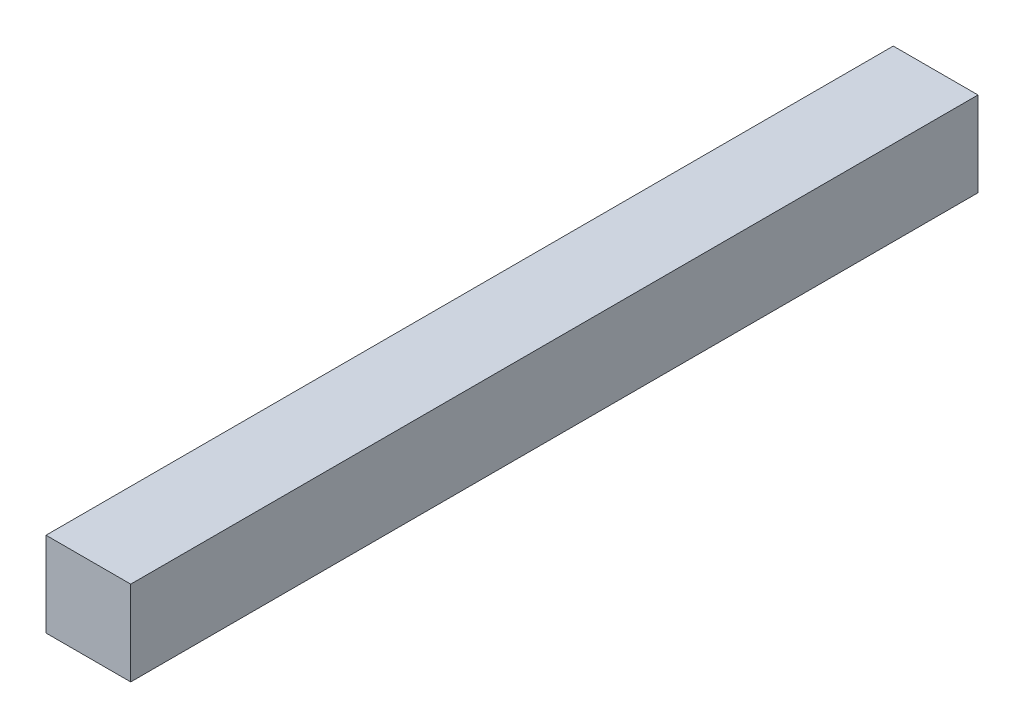
ISO-10303-21;
HEADER;
FILE_DESCRIPTION(('STEP AP214'),'2;1');
FILE_NAME('part.step','',(''),(''),'','','');
FILE_SCHEMA(('AUTOMOTIVE_DESIGN { 1 0 10303 214 1 1 1 1 }'));
ENDSEC;
DATA;
#1=APPLICATION_CONTEXT('core data for automotive mechanical design processes');
#2=APPLICATION_PROTOCOL_DEFINITION('international standard','automotive_design',2000,#1);
#3=PRODUCT_CONTEXT('',#1,'mechanical');
#4=PRODUCT('Part','Part','',(#3));
#5=PRODUCT_RELATED_PRODUCT_CATEGORY('part','',(#4));
#6=PRODUCT_DEFINITION_FORMATION('','',#4);
#7=PRODUCT_DEFINITION_CONTEXT('part definition',#1,'design');
#8=PRODUCT_DEFINITION('design','',#6,#7);
#9=PRODUCT_DEFINITION_SHAPE('','',#8);
#10=(LENGTH_UNIT() NAMED_UNIT(*) SI_UNIT(.MILLI.,.METRE.));
#11=(NAMED_UNIT(*) PLANE_ANGLE_UNIT() SI_UNIT($,.RADIAN.));
#12=(NAMED_UNIT(*) SI_UNIT($,.STERADIAN.) SOLID_ANGLE_UNIT());
#13=UNCERTAINTY_MEASURE_WITH_UNIT(LENGTH_MEASURE(1.E-05),#10,'distance_accuracy_value','');
#14=(GEOMETRIC_REPRESENTATION_CONTEXT(3) GLOBAL_UNCERTAINTY_ASSIGNED_CONTEXT((#13)) GLOBAL_UNIT_ASSIGNED_CONTEXT((#10,
#11,#12)) REPRESENTATION_CONTEXT('',''));
#15=CARTESIAN_POINT('',(0.,0.,0.));
#16=DIRECTION('',(0.,0.,1.));
#17=DIRECTION('',(1.,0.,0.));
#18=AXIS2_PLACEMENT_3D('',#15,#16,#17);
#19=CARTESIAN_POINT('',(0.,0.,30.));
#20=DIRECTION('',(-1.,0.,0.));
#21=DIRECTION('',(0.,0.,1.));
#22=AXIS2_PLACEMENT_3D('',#19,#20,#21);
#23=PLANE('',#22);
#24=DIRECTION('',(0.,1.,0.));
#25=VECTOR('',#24,1.);
#26=CARTESIAN_POINT('',(0.,0.,0.));
#27=LINE('',#26,#25);
#28=CARTESIAN_POINT('',(0.,0.,0.));
#29=VERTEX_POINT('',#28);
#30=CARTESIAN_POINT('',(0.,3.,0.));
#31=VERTEX_POINT('',#30);
#32=EDGE_CURVE('E110',#29,#31,#27,.T.);
#33=ORIENTED_EDGE('',*,*,#32,.F.);
#34=DIRECTION('',(0.,0.,-1.));
#35=VECTOR('',#34,1.);
#36=CARTESIAN_POINT('',(0.,0.,30.));
#37=LINE('',#36,#35);
#38=CARTESIAN_POINT('',(0.,0.,30.));
#39=VERTEX_POINT('',#38);
#40=EDGE_CURVE('E11',#39,#29,#37,.T.);
#41=ORIENTED_EDGE('',*,*,#40,.F.);
#42=DIRECTION('',(0.,1.,0.));
#43=VECTOR('',#42,1.);
#44=CARTESIAN_POINT('',(0.,0.,30.));
#45=LINE('',#44,#43);
#46=CARTESIAN_POINT('',(0.,3.,30.));
#47=VERTEX_POINT('',#46);
#48=EDGE_CURVE('E103',#39,#47,#45,.T.);
#49=ORIENTED_EDGE('',*,*,#48,.T.);
#50=DIRECTION('',(0.,0.,-1.));
#51=VECTOR('',#50,1.);
#52=CARTESIAN_POINT('',(0.,3.,30.));
#53=LINE('',#52,#51);
#54=EDGE_CURVE('E42',#47,#31,#53,.T.);
#55=ORIENTED_EDGE('',*,*,#54,.T.);
#56=EDGE_LOOP('',(#33,#41,#49,#55));
#57=FACE_BOUND('',#56,.T.);
#58=ADVANCED_FACE('F39',(#57),#23,.T.);
#59=CARTESIAN_POINT('',(0.,0.,30.));
#60=DIRECTION('',(0.,1.,0.));
#61=DIRECTION('',(0.,0.,1.));
#62=AXIS2_PLACEMENT_3D('',#59,#60,#61);
#63=PLANE('',#62);
#64=DIRECTION('',(1.,0.,0.));
#65=VECTOR('',#64,1.);
#66=CARTESIAN_POINT('',(0.,0.,0.));
#67=LINE('',#66,#65);
#68=CARTESIAN_POINT('',(3.,0.,0.));
#69=VERTEX_POINT('',#68);
#70=EDGE_CURVE('E73',#29,#69,#67,.T.);
#71=ORIENTED_EDGE('',*,*,#70,.T.);
#72=DIRECTION('',(0.,0.,-1.));
#73=VECTOR('',#72,1.);
#74=CARTESIAN_POINT('',(3.,0.,30.));
#75=LINE('',#74,#73);
#76=CARTESIAN_POINT('',(3.,0.,30.));
#77=VERTEX_POINT('',#76);
#78=EDGE_CURVE('E49',#77,#69,#75,.T.);
#79=ORIENTED_EDGE('',*,*,#78,.F.);
#80=DIRECTION('',(1.,0.,0.));
#81=VECTOR('',#80,1.);
#82=CARTESIAN_POINT('',(0.,0.,30.));
#83=LINE('',#82,#81);
#84=EDGE_CURVE('E90',#39,#77,#83,.T.);
#85=ORIENTED_EDGE('',*,*,#84,.F.);
#86=ORIENTED_EDGE('',*,*,#40,.T.);
#87=EDGE_LOOP('',(#71,#79,#85,#86));
#88=FACE_BOUND('',#87,.T.);
#89=ADVANCED_FACE('F126',(#88),#63,.F.);
#90=CARTESIAN_POINT('',(3.,0.,30.));
#91=DIRECTION('',(-1.,0.,0.));
#92=DIRECTION('',(0.,0.,1.));
#93=AXIS2_PLACEMENT_3D('',#90,#91,#92);
#94=PLANE('',#93);
#95=DIRECTION('',(0.,1.,0.));
#96=VECTOR('',#95,1.);
#97=CARTESIAN_POINT('',(3.,0.,0.));
#98=LINE('',#97,#96);
#99=CARTESIAN_POINT('',(3.,3.,0.));
#100=VERTEX_POINT('',#99);
#101=EDGE_CURVE('E98',#69,#100,#98,.T.);
#102=ORIENTED_EDGE('',*,*,#101,.T.);
#103=DIRECTION('',(0.,0.,-1.));
#104=VECTOR('',#103,1.);
#105=CARTESIAN_POINT('',(3.,3.,30.));
#106=LINE('',#105,#104);
#107=CARTESIAN_POINT('',(3.,3.,30.));
#108=VERTEX_POINT('',#107);
#109=EDGE_CURVE('E95',#108,#100,#106,.T.);
#110=ORIENTED_EDGE('',*,*,#109,.F.);
#111=DIRECTION('',(0.,1.,0.));
#112=VECTOR('',#111,1.);
#113=CARTESIAN_POINT('',(3.,0.,30.));
#114=LINE('',#113,#112);
#115=EDGE_CURVE('E85',#77,#108,#114,.T.);
#116=ORIENTED_EDGE('',*,*,#115,.F.);
#117=ORIENTED_EDGE('',*,*,#78,.T.);
#118=EDGE_LOOP('',(#102,#110,#116,#117));
#119=FACE_BOUND('',#118,.T.);
#120=ADVANCED_FACE('F96',(#119),#94,.F.);
#121=CARTESIAN_POINT('',(0.,3.,30.));
#122=DIRECTION('',(0.,1.,0.));
#123=DIRECTION('',(0.,0.,1.));
#124=AXIS2_PLACEMENT_3D('',#121,#122,#123);
#125=PLANE('',#124);
#126=DIRECTION('',(1.,0.,0.));
#127=VECTOR('',#126,1.);
#128=CARTESIAN_POINT('',(0.,3.,0.));
#129=LINE('',#128,#127);
#130=EDGE_CURVE('E114',#31,#100,#129,.T.);
#131=ORIENTED_EDGE('',*,*,#130,.F.);
#132=ORIENTED_EDGE('',*,*,#54,.F.);
#133=DIRECTION('',(1.,0.,0.));
#134=VECTOR('',#133,1.);
#135=CARTESIAN_POINT('',(0.,3.,30.));
#136=LINE('',#135,#134);
#137=EDGE_CURVE('E89',#47,#108,#136,.T.);
#138=ORIENTED_EDGE('',*,*,#137,.T.);
#139=ORIENTED_EDGE('',*,*,#109,.T.);
#140=EDGE_LOOP('',(#131,#132,#138,#139));
#141=FACE_BOUND('',#140,.T.);
#142=ADVANCED_FACE('F101',(#141),#125,.T.);
#143=CARTESIAN_POINT('',(0.,0.,30.));
#144=DIRECTION('',(0.,0.,-1.));
#145=DIRECTION('',(-1.,0.,0.));
#146=AXIS2_PLACEMENT_3D('',#143,#144,#145);
#147=PLANE('',#146);
#148=ORIENTED_EDGE('',*,*,#48,.F.);
#149=ORIENTED_EDGE('',*,*,#84,.T.);
#150=ORIENTED_EDGE('',*,*,#115,.T.);
#151=ORIENTED_EDGE('',*,*,#137,.F.);
#152=EDGE_LOOP('',(#148,#149,#150,#151));
#153=FACE_BOUND('',#152,.T.);
#154=ADVANCED_FACE('F88',(#153),#147,.F.);
#155=CARTESIAN_POINT('',(0.,0.,0.));
#156=DIRECTION('',(0.,0.,-1.));
#157=DIRECTION('',(-1.,0.,0.));
#158=AXIS2_PLACEMENT_3D('',#155,#156,#157);
#159=PLANE('',#158);
#160=ORIENTED_EDGE('',*,*,#32,.T.);
#161=ORIENTED_EDGE('',*,*,#130,.T.);
#162=ORIENTED_EDGE('',*,*,#101,.F.);
#163=ORIENTED_EDGE('',*,*,#70,.F.);
#164=EDGE_LOOP('',(#160,#161,#162,#163));
#165=FACE_BOUND('',#164,.T.);
#166=ADVANCED_FACE('F123',(#165),#159,.T.);
#167=CLOSED_SHELL('',(#58,#89,#120,#142,#154,#166));
#168=MANIFOLD_SOLID_BREP('B2',#167);
#169=ADVANCED_BREP_SHAPE_REPRESENTATION('',(#18,#168),#14);
#170=SHAPE_DEFINITION_REPRESENTATION(#9,#169);
ENDSEC;
END-ISO-10303-21;
